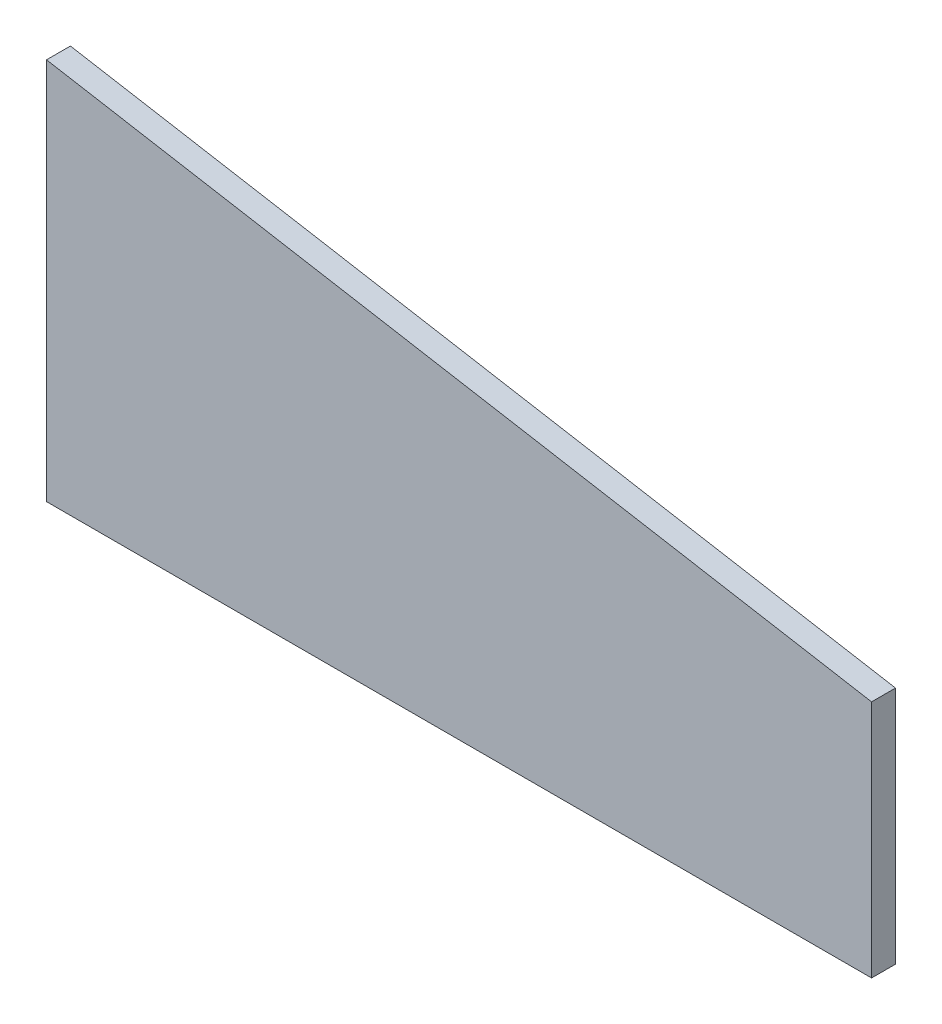
ISO-10303-21;
HEADER;
FILE_DESCRIPTION(('STEP AP214'),'2;1');
FILE_NAME('part.step','',(''),(''),'','','');
FILE_SCHEMA(('AUTOMOTIVE_DESIGN { 1 0 10303 214 1 1 1 1 }'));
ENDSEC;
DATA;
#1=APPLICATION_CONTEXT('core data for automotive mechanical design processes');
#2=APPLICATION_PROTOCOL_DEFINITION('international standard','automotive_design',2000,#1);
#3=PRODUCT_CONTEXT('',#1,'mechanical');
#4=PRODUCT('Part','Part','',(#3));
#5=PRODUCT_RELATED_PRODUCT_CATEGORY('part','',(#4));
#6=PRODUCT_DEFINITION_FORMATION('','',#4);
#7=PRODUCT_DEFINITION_CONTEXT('part definition',#1,'design');
#8=PRODUCT_DEFINITION('design','',#6,#7);
#9=PRODUCT_DEFINITION_SHAPE('','',#8);
#10=(LENGTH_UNIT() NAMED_UNIT(*) SI_UNIT(.MILLI.,.METRE.));
#11=(NAMED_UNIT(*) PLANE_ANGLE_UNIT() SI_UNIT($,.RADIAN.));
#12=(NAMED_UNIT(*) SI_UNIT($,.STERADIAN.) SOLID_ANGLE_UNIT());
#13=UNCERTAINTY_MEASURE_WITH_UNIT(LENGTH_MEASURE(1.E-05),#10,'distance_accuracy_value','');
#14=(GEOMETRIC_REPRESENTATION_CONTEXT(3) GLOBAL_UNCERTAINTY_ASSIGNED_CONTEXT((#13)) GLOBAL_UNIT_ASSIGNED_CONTEXT((#10,
#11,#12)) REPRESENTATION_CONTEXT('',''));
#15=CARTESIAN_POINT('',(0.,0.,0.));
#16=DIRECTION('',(0.,0.,1.));
#17=DIRECTION('',(1.,0.,0.));
#18=AXIS2_PLACEMENT_3D('',#15,#16,#17);
#19=CARTESIAN_POINT('',(219.075,0.,6.35));
#20=DIRECTION('',(0.,1.,0.));
#21=DIRECTION('',(-1.,0.,0.));
#22=AXIS2_PLACEMENT_3D('',#19,#20,#21);
#23=PLANE('',#22);
#24=DIRECTION('',(1.,0.,0.));
#25=VECTOR('',#24,1.);
#26=CARTESIAN_POINT('',(219.075,0.,0.));
#27=LINE('',#26,#25);
#28=CARTESIAN_POINT('',(0.,0.,0.));
#29=VERTEX_POINT('',#28);
#30=CARTESIAN_POINT('',(219.075,0.,0.));
#31=VERTEX_POINT('',#30);
#32=EDGE_CURVE('E96',#29,#31,#27,.T.);
#33=ORIENTED_EDGE('',*,*,#32,.T.);
#34=DIRECTION('',(0.,0.,-1.));
#35=VECTOR('',#34,1.);
#36=CARTESIAN_POINT('',(219.075,0.,6.35));
#37=LINE('',#36,#35);
#38=CARTESIAN_POINT('',(219.075,0.,6.35));
#39=VERTEX_POINT('',#38);
#40=EDGE_CURVE('E11',#39,#31,#37,.T.);
#41=ORIENTED_EDGE('',*,*,#40,.F.);
#42=DIRECTION('',(1.,0.,0.));
#43=VECTOR('',#42,1.);
#44=CARTESIAN_POINT('',(219.075,0.,6.35));
#45=LINE('',#44,#43);
#46=CARTESIAN_POINT('',(0.,0.,6.35));
#47=VERTEX_POINT('',#46);
#48=EDGE_CURVE('E84',#47,#39,#45,.T.);
#49=ORIENTED_EDGE('',*,*,#48,.F.);
#50=DIRECTION('',(0.,0.,-1.));
#51=VECTOR('',#50,1.);
#52=CARTESIAN_POINT('',(0.,0.,6.35));
#53=LINE('',#52,#51);
#54=EDGE_CURVE('E92',#47,#29,#53,.T.);
#55=ORIENTED_EDGE('',*,*,#54,.T.);
#56=EDGE_LOOP('',(#33,#41,#49,#55));
#57=FACE_BOUND('',#56,.T.);
#58=ADVANCED_FACE('F33',(#57),#23,.F.);
#59=CARTESIAN_POINT('',(219.075,63.5,6.35));
#60=DIRECTION('',(-1.,0.,0.));
#61=DIRECTION('',(0.,-1.,0.));
#62=AXIS2_PLACEMENT_3D('',#59,#60,#61);
#63=PLANE('',#62);
#64=DIRECTION('',(0.,1.,0.));
#65=VECTOR('',#64,1.);
#66=CARTESIAN_POINT('',(219.075,63.5,0.));
#67=LINE('',#66,#65);
#68=CARTESIAN_POINT('',(219.075,63.5,0.));
#69=VERTEX_POINT('',#68);
#70=EDGE_CURVE('E88',#31,#69,#67,.T.);
#71=ORIENTED_EDGE('',*,*,#70,.T.);
#72=DIRECTION('',(0.,0.,-1.));
#73=VECTOR('',#72,1.);
#74=CARTESIAN_POINT('',(219.075,63.5,6.35));
#75=LINE('',#74,#73);
#76=CARTESIAN_POINT('',(219.075,63.5,6.35));
#77=VERTEX_POINT('',#76);
#78=EDGE_CURVE('E41',#77,#69,#75,.T.);
#79=ORIENTED_EDGE('',*,*,#78,.F.);
#80=DIRECTION('',(0.,1.,0.));
#81=VECTOR('',#80,1.);
#82=CARTESIAN_POINT('',(219.075,63.5,6.35));
#83=LINE('',#82,#81);
#84=EDGE_CURVE('E79',#39,#77,#83,.T.);
#85=ORIENTED_EDGE('',*,*,#84,.F.);
#86=ORIENTED_EDGE('',*,*,#40,.T.);
#87=EDGE_LOOP('',(#71,#79,#85,#86));
#88=FACE_BOUND('',#87,.T.);
#89=ADVANCED_FACE('F87',(#88),#63,.F.);
#90=CARTESIAN_POINT('',(0.,101.6,6.35));
#91=DIRECTION('',(-0.171341174751248,-0.985211754819674,0.));
#92=DIRECTION('',(0.985211754819675,-0.171341174751248,0.));
#93=AXIS2_PLACEMENT_3D('',#90,#91,#92);
#94=PLANE('',#93);
#95=DIRECTION('',(-0.985211754819674,0.171341174751248,0.));
#96=VECTOR('',#95,1.);
#97=CARTESIAN_POINT('',(0.,101.6,0.));
#98=LINE('',#97,#96);
#99=CARTESIAN_POINT('',(0.,101.6,0.));
#100=VERTEX_POINT('',#99);
#101=EDGE_CURVE('E66',#69,#100,#98,.T.);
#102=ORIENTED_EDGE('',*,*,#101,.T.);
#103=DIRECTION('',(0.,0.,-1.));
#104=VECTOR('',#103,1.);
#105=CARTESIAN_POINT('',(0.,101.6,6.35));
#106=LINE('',#105,#104);
#107=CARTESIAN_POINT('',(0.,101.6,6.35));
#108=VERTEX_POINT('',#107);
#109=EDGE_CURVE('E89',#108,#100,#106,.T.);
#110=ORIENTED_EDGE('',*,*,#109,.F.);
#111=DIRECTION('',(-0.985211754819674,0.171341174751248,0.));
#112=VECTOR('',#111,1.);
#113=CARTESIAN_POINT('',(0.,101.6,6.35));
#114=LINE('',#113,#112);
#115=EDGE_CURVE('E82',#77,#108,#114,.T.);
#116=ORIENTED_EDGE('',*,*,#115,.F.);
#117=ORIENTED_EDGE('',*,*,#78,.T.);
#118=EDGE_LOOP('',(#102,#110,#116,#117));
#119=FACE_BOUND('',#118,.T.);
#120=ADVANCED_FACE('F90',(#119),#94,.F.);
#121=CARTESIAN_POINT('',(0.,0.,6.35));
#122=DIRECTION('',(1.,0.,0.));
#123=DIRECTION('',(0.,0.,-1.));
#124=AXIS2_PLACEMENT_3D('',#121,#122,#123);
#125=PLANE('',#124);
#126=DIRECTION('',(0.,-1.,0.));
#127=VECTOR('',#126,1.);
#128=CARTESIAN_POINT('',(0.,0.,0.));
#129=LINE('',#128,#127);
#130=EDGE_CURVE('E72',#100,#29,#129,.T.);
#131=ORIENTED_EDGE('',*,*,#130,.T.);
#132=ORIENTED_EDGE('',*,*,#54,.F.);
#133=DIRECTION('',(0.,-1.,0.));
#134=VECTOR('',#133,1.);
#135=CARTESIAN_POINT('',(0.,0.,6.35));
#136=LINE('',#135,#134);
#137=EDGE_CURVE('E49',#108,#47,#136,.T.);
#138=ORIENTED_EDGE('',*,*,#137,.F.);
#139=ORIENTED_EDGE('',*,*,#109,.T.);
#140=EDGE_LOOP('',(#131,#132,#138,#139));
#141=FACE_BOUND('',#140,.T.);
#142=ADVANCED_FACE('F103',(#141),#125,.F.);
#143=CARTESIAN_POINT('',(0.,0.,6.35));
#144=DIRECTION('',(0.,0.,-1.));
#145=DIRECTION('',(-1.,0.,0.));
#146=AXIS2_PLACEMENT_3D('',#143,#144,#145);
#147=PLANE('',#146);
#148=ORIENTED_EDGE('',*,*,#48,.T.);
#149=ORIENTED_EDGE('',*,*,#84,.T.);
#150=ORIENTED_EDGE('',*,*,#115,.T.);
#151=ORIENTED_EDGE('',*,*,#137,.T.);
#152=EDGE_LOOP('',(#148,#149,#150,#151));
#153=FACE_BOUND('',#152,.T.);
#154=ADVANCED_FACE('F80',(#153),#147,.F.);
#155=CARTESIAN_POINT('',(0.,0.,0.));
#156=DIRECTION('',(0.,0.,-1.));
#157=DIRECTION('',(-1.,0.,0.));
#158=AXIS2_PLACEMENT_3D('',#155,#156,#157);
#159=PLANE('',#158);
#160=ORIENTED_EDGE('',*,*,#32,.F.);
#161=ORIENTED_EDGE('',*,*,#130,.F.);
#162=ORIENTED_EDGE('',*,*,#101,.F.);
#163=ORIENTED_EDGE('',*,*,#70,.F.);
#164=EDGE_LOOP('',(#160,#161,#162,#163));
#165=FACE_BOUND('',#164,.T.);
#166=ADVANCED_FACE('F106',(#165),#159,.T.);
#167=CLOSED_SHELL('',(#58,#89,#120,#142,#154,#166));
#168=MANIFOLD_SOLID_BREP('B2',#167);
#169=ADVANCED_BREP_SHAPE_REPRESENTATION('',(#18,#168),#14);
#170=SHAPE_DEFINITION_REPRESENTATION(#9,#169);
ENDSEC;
END-ISO-10303-21;
